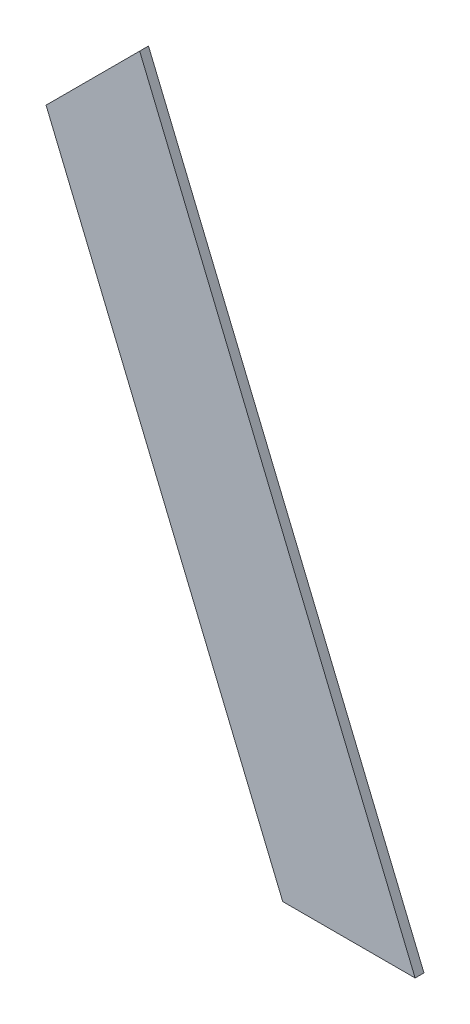
ISO-10303-21;
HEADER;
FILE_DESCRIPTION(('STEP AP214'),'2;1');
FILE_NAME('part.step','',(''),(''),'','','');
FILE_SCHEMA(('AUTOMOTIVE_DESIGN { 1 0 10303 214 1 1 1 1 }'));
ENDSEC;
DATA;
#1=APPLICATION_CONTEXT('core data for automotive mechanical design processes');
#2=APPLICATION_PROTOCOL_DEFINITION('international standard','automotive_design',2000,#1);
#3=PRODUCT_CONTEXT('',#1,'mechanical');
#4=PRODUCT('Part','Part','',(#3));
#5=PRODUCT_RELATED_PRODUCT_CATEGORY('part','',(#4));
#6=PRODUCT_DEFINITION_FORMATION('','',#4);
#7=PRODUCT_DEFINITION_CONTEXT('part definition',#1,'design');
#8=PRODUCT_DEFINITION('design','',#6,#7);
#9=PRODUCT_DEFINITION_SHAPE('','',#8);
#10=(LENGTH_UNIT() NAMED_UNIT(*) SI_UNIT(.MILLI.,.METRE.));
#11=(NAMED_UNIT(*) PLANE_ANGLE_UNIT() SI_UNIT($,.RADIAN.));
#12=(NAMED_UNIT(*) SI_UNIT($,.STERADIAN.) SOLID_ANGLE_UNIT());
#13=UNCERTAINTY_MEASURE_WITH_UNIT(LENGTH_MEASURE(1.E-05),#10,'distance_accuracy_value','');
#14=(GEOMETRIC_REPRESENTATION_CONTEXT(3) GLOBAL_UNCERTAINTY_ASSIGNED_CONTEXT((#13)) GLOBAL_UNIT_ASSIGNED_CONTEXT((#10,
#11,#12)) REPRESENTATION_CONTEXT('',''));
#15=CARTESIAN_POINT('',(0.,0.,0.));
#16=DIRECTION('',(0.,0.,1.));
#17=DIRECTION('',(1.,0.,0.));
#18=AXIS2_PLACEMENT_3D('',#15,#16,#17);
#19=CARTESIAN_POINT('',(26882.3735421175,11834.3060241721,908.));
#20=DIRECTION('',(0.,0.,1.));
#21=DIRECTION('',(1.,0.,0.));
#22=AXIS2_PLACEMENT_3D('',#19,#20,#21);
#23=PLANE('',#22);
#24=DIRECTION('',(-0.707106781186548,-0.707106781186547,0.));
#25=VECTOR('',#24,1.);
#26=CARTESIAN_POINT('',(26841.1968202135,11895.1638477919,908.));
#27=LINE('',#26,#25);
#28=CARTESIAN_POINT('',(26862.4100236491,11916.3770512275,908.));
#29=VERTEX_POINT('',#28);
#30=CARTESIAN_POINT('',(26841.1968202135,11895.1638477919,908.));
#31=VERTEX_POINT('',#30);
#32=EDGE_CURVE('E56',#29,#31,#27,.T.);
#33=ORIENTED_EDGE('',*,*,#32,.F.);
#34=DIRECTION('',(-0.382683432365092,0.923879532511286,0.));
#35=VECTOR('',#34,1.);
#36=CARTESIAN_POINT('',(26863.8744897432,11912.8415173215,908.));
#37=LINE('',#36,#35);
#38=CARTESIAN_POINT('',(26924.8257165079,11765.6922390229,908.));
#39=VERTEX_POINT('',#38);
#40=EDGE_CURVE('E20',#39,#29,#37,.T.);
#41=ORIENTED_EDGE('',*,*,#40,.F.);
#42=DIRECTION('',(1.,0.,0.));
#43=VECTOR('',#42,1.);
#44=CARTESIAN_POINT('',(26924.8257165079,11765.6922390229,908.));
#45=LINE('',#44,#43);
#46=CARTESIAN_POINT('',(26894.8257165079,11765.6922390229,908.));
#47=VERTEX_POINT('',#46);
#48=EDGE_CURVE('E79',#47,#39,#45,.T.);
#49=ORIENTED_EDGE('',*,*,#48,.F.);
#50=DIRECTION('',(0.382683432365061,-0.923879532511299,0.));
#51=VECTOR('',#50,1.);
#52=CARTESIAN_POINT('',(26894.8257165079,11765.6922390229,908.));
#53=LINE('',#52,#51);
#54=EDGE_CURVE('E61',#31,#47,#53,.T.);
#55=ORIENTED_EDGE('',*,*,#54,.F.);
#56=EDGE_LOOP('',(#33,#41,#49,#55));
#57=FACE_BOUND('',#56,.T.);
#58=ADVANCED_FACE('F17',(#57),#23,.F.);
#59=CARTESIAN_POINT('',(26863.8744897432,11912.8415173215,908.));
#60=DIRECTION('',(0.923879532511286,0.382683432365092,0.));
#61=DIRECTION('',(-0.382683432365092,0.923879532511286,0.));
#62=AXIS2_PLACEMENT_3D('',#59,#60,#61);
#63=PLANE('',#62);
#64=DIRECTION('',(-0.38268343236509,0.923879532511287,0.));
#65=VECTOR('',#64,1.);
#66=CARTESIAN_POINT('',(26924.8257165079,11765.6922390229,910.));
#67=LINE('',#66,#65);
#68=CARTESIAN_POINT('',(26924.8257165079,11765.6922390229,910.));
#69=VERTEX_POINT('',#68);
#70=CARTESIAN_POINT('',(26862.4100236491,11916.3770512275,910.));
#71=VERTEX_POINT('',#70);
#72=EDGE_CURVE('E83',#69,#71,#67,.T.);
#73=ORIENTED_EDGE('',*,*,#72,.F.);
#74=DIRECTION('',(0.,0.,1.));
#75=VECTOR('',#74,1.);
#76=CARTESIAN_POINT('',(26924.8257165079,11765.6922390229,908.));
#77=LINE('',#76,#75);
#78=EDGE_CURVE('E68',#39,#69,#77,.T.);
#79=ORIENTED_EDGE('',*,*,#78,.F.);
#80=ORIENTED_EDGE('',*,*,#40,.T.);
#81=DIRECTION('',(0.,0.,1.));
#82=VECTOR('',#81,1.);
#83=CARTESIAN_POINT('',(26862.4100236491,11916.3770512275,908.));
#84=LINE('',#83,#82);
#85=EDGE_CURVE('E63',#71,#29,#84,.F.);
#86=ORIENTED_EDGE('',*,*,#85,.F.);
#87=EDGE_LOOP('',(#73,#79,#80,#86));
#88=FACE_BOUND('',#87,.T.);
#89=ADVANCED_FACE('F65',(#88),#63,.T.);
#90=CARTESIAN_POINT('',(26841.1968202135,11895.1638477919,908.));
#91=DIRECTION('',(-0.707106781186547,0.707106781186548,0.));
#92=DIRECTION('',(-0.707106781186548,-0.707106781186547,0.));
#93=AXIS2_PLACEMENT_3D('',#90,#91,#92);
#94=PLANE('',#93);
#95=DIRECTION('',(-0.70710678118637,-0.707106781186725,0.));
#96=VECTOR('',#95,1.);
#97=CARTESIAN_POINT('',(26862.4100236491,11916.3770512275,910.));
#98=LINE('',#97,#96);
#99=CARTESIAN_POINT('',(26841.1968202135,11895.1638477919,910.));
#100=VERTEX_POINT('',#99);
#101=EDGE_CURVE('E72',#71,#100,#98,.T.);
#102=ORIENTED_EDGE('',*,*,#101,.F.);
#103=ORIENTED_EDGE('',*,*,#85,.T.);
#104=ORIENTED_EDGE('',*,*,#32,.T.);
#105=DIRECTION('',(0.,0.,1.));
#106=VECTOR('',#105,1.);
#107=CARTESIAN_POINT('',(26841.1968202135,11895.1638477919,908.));
#108=LINE('',#107,#106);
#109=EDGE_CURVE('E74',#100,#31,#108,.F.);
#110=ORIENTED_EDGE('',*,*,#109,.F.);
#111=EDGE_LOOP('',(#102,#103,#104,#110));
#112=FACE_BOUND('',#111,.T.);
#113=ADVANCED_FACE('F70',(#112),#94,.T.);
#114=CARTESIAN_POINT('',(26894.8257165079,11765.6922390229,908.));
#115=DIRECTION('',(-0.923879532511299,-0.382683432365061,0.));
#116=DIRECTION('',(0.382683432365061,-0.923879532511299,0.));
#117=AXIS2_PLACEMENT_3D('',#114,#115,#116);
#118=PLANE('',#117);
#119=ORIENTED_EDGE('',*,*,#54,.T.);
#120=DIRECTION('',(0.,0.,1.));
#121=VECTOR('',#120,1.);
#122=CARTESIAN_POINT('',(26894.8257165079,11765.6922390229,908.));
#123=LINE('',#122,#121);
#124=CARTESIAN_POINT('',(26894.8257165079,11765.6922390229,910.));
#125=VERTEX_POINT('',#124);
#126=EDGE_CURVE('E35',#125,#47,#123,.F.);
#127=ORIENTED_EDGE('',*,*,#126,.F.);
#128=DIRECTION('',(0.382683432364986,-0.92387953251133,0.));
#129=VECTOR('',#128,1.);
#130=CARTESIAN_POINT('',(26841.1968202135,11895.1638477919,910.));
#131=LINE('',#130,#129);
#132=EDGE_CURVE('E26',#100,#125,#131,.T.);
#133=ORIENTED_EDGE('',*,*,#132,.F.);
#134=ORIENTED_EDGE('',*,*,#109,.T.);
#135=EDGE_LOOP('',(#119,#127,#133,#134));
#136=FACE_BOUND('',#135,.T.);
#137=ADVANCED_FACE('F89',(#136),#118,.T.);
#138=CARTESIAN_POINT('',(26924.8257165079,11765.6922390229,908.));
#139=DIRECTION('',(0.,-1.,0.));
#140=DIRECTION('',(1.,0.,0.));
#141=AXIS2_PLACEMENT_3D('',#138,#139,#140);
#142=PLANE('',#141);
#143=DIRECTION('',(1.,0.,0.));
#144=VECTOR('',#143,1.);
#145=CARTESIAN_POINT('',(26882.3735421175,11765.6922390229,910.));
#146=LINE('',#145,#144);
#147=EDGE_CURVE('E11',#125,#69,#146,.T.);
#148=ORIENTED_EDGE('',*,*,#147,.F.);
#149=ORIENTED_EDGE('',*,*,#126,.T.);
#150=ORIENTED_EDGE('',*,*,#48,.T.);
#151=ORIENTED_EDGE('',*,*,#78,.T.);
#152=EDGE_LOOP('',(#148,#149,#150,#151));
#153=FACE_BOUND('',#152,.T.);
#154=ADVANCED_FACE('F91',(#153),#142,.T.);
#155=CARTESIAN_POINT('',(26882.3735421175,11834.3060241721,910.));
#156=DIRECTION('',(0.,0.,1.));
#157=DIRECTION('',(1.,0.,0.));
#158=AXIS2_PLACEMENT_3D('',#155,#156,#157);
#159=PLANE('',#158);
#160=ORIENTED_EDGE('',*,*,#132,.T.);
#161=ORIENTED_EDGE('',*,*,#147,.T.);
#162=ORIENTED_EDGE('',*,*,#72,.T.);
#163=ORIENTED_EDGE('',*,*,#101,.T.);
#164=EDGE_LOOP('',(#160,#161,#162,#163));
#165=FACE_BOUND('',#164,.T.);
#166=ADVANCED_FACE('F88',(#165),#159,.T.);
#167=CLOSED_SHELL('',(#58,#89,#113,#137,#154,#166));
#168=MANIFOLD_SOLID_BREP('B1',#167);
#169=ADVANCED_BREP_SHAPE_REPRESENTATION('',(#18,#168),#14);
#170=SHAPE_DEFINITION_REPRESENTATION(#9,#169);
ENDSEC;
END-ISO-10303-21;
